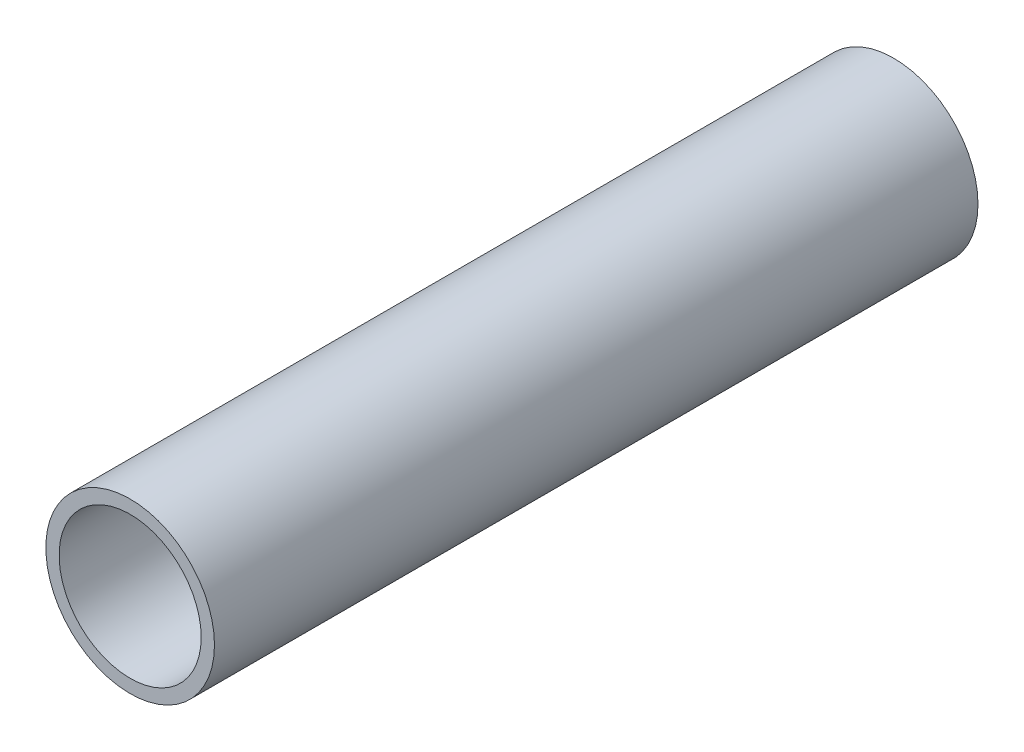
ISO-10303-21;
HEADER;
FILE_DESCRIPTION(('STEP AP214'),'2;1');
FILE_NAME('part.step','',(''),(''),'','','');
FILE_SCHEMA(('AUTOMOTIVE_DESIGN { 1 0 10303 214 1 1 1 1 }'));
ENDSEC;
DATA;
#1=APPLICATION_CONTEXT('core data for automotive mechanical design processes');
#2=APPLICATION_PROTOCOL_DEFINITION('international standard','automotive_design',2000,#1);
#3=PRODUCT_CONTEXT('',#1,'mechanical');
#4=PRODUCT('Part','Part','',(#3));
#5=PRODUCT_RELATED_PRODUCT_CATEGORY('part','',(#4));
#6=PRODUCT_DEFINITION_FORMATION('','',#4);
#7=PRODUCT_DEFINITION_CONTEXT('part definition',#1,'design');
#8=PRODUCT_DEFINITION('design','',#6,#7);
#9=PRODUCT_DEFINITION_SHAPE('','',#8);
#10=(LENGTH_UNIT() NAMED_UNIT(*) SI_UNIT(.MILLI.,.METRE.));
#11=(NAMED_UNIT(*) PLANE_ANGLE_UNIT() SI_UNIT($,.RADIAN.));
#12=(NAMED_UNIT(*) SI_UNIT($,.STERADIAN.) SOLID_ANGLE_UNIT());
#13=UNCERTAINTY_MEASURE_WITH_UNIT(LENGTH_MEASURE(1.E-05),#10,'distance_accuracy_value','');
#14=(GEOMETRIC_REPRESENTATION_CONTEXT(3) GLOBAL_UNCERTAINTY_ASSIGNED_CONTEXT((#13)) GLOBAL_UNIT_ASSIGNED_CONTEXT((#10,
#11,#12)) REPRESENTATION_CONTEXT('',''));
#15=CARTESIAN_POINT('',(0.,0.,0.));
#16=DIRECTION('',(0.,0.,1.));
#17=DIRECTION('',(1.,0.,0.));
#18=AXIS2_PLACEMENT_3D('',#15,#16,#17);
#19=CARTESIAN_POINT('',(0.,0.,115.));
#20=DIRECTION('',(0.,0.,1.));
#21=DIRECTION('',(1.,0.,0.));
#22=AXIS2_PLACEMENT_3D('',#19,#20,#21);
#23=PLANE('',#22);
#24=CARTESIAN_POINT('',(0.,0.,115.));
#25=DIRECTION('',(0.,0.,1.));
#26=DIRECTION('',(1.,0.,0.));
#27=AXIS2_PLACEMENT_3D('',#24,#25,#26);
#28=CIRCLE('',#27,12.7);
#29=CARTESIAN_POINT('',(12.7,0.,115.));
#30=VERTEX_POINT('',#29);
#31=EDGE_CURVE('E10',#30,#30,#28,.T.);
#32=ORIENTED_EDGE('',*,*,#31,.T.);
#33=EDGE_LOOP('',(#32));
#34=FACE_BOUND('',#33,.T.);
#35=CARTESIAN_POINT('',(0.,0.,115.));
#36=DIRECTION('',(0.,0.,1.));
#37=DIRECTION('',(1.,0.,0.));
#38=AXIS2_PLACEMENT_3D('',#35,#36,#37);
#39=CIRCLE('',#38,10.7);
#40=CARTESIAN_POINT('',(10.7,0.,115.));
#41=VERTEX_POINT('',#40);
#42=EDGE_CURVE('E43',#41,#41,#39,.T.);
#43=ORIENTED_EDGE('',*,*,#42,.F.);
#44=EDGE_LOOP('',(#43));
#45=FACE_BOUND('',#44,.T.);
#46=ADVANCED_FACE('F32',(#34,#45),#23,.T.);
#47=CARTESIAN_POINT('',(0.,0.,0.));
#48=DIRECTION('',(0.,0.,1.));
#49=DIRECTION('',(1.,0.,0.));
#50=AXIS2_PLACEMENT_3D('',#47,#48,#49);
#51=PLANE('',#50);
#52=CARTESIAN_POINT('',(0.,0.,0.));
#53=DIRECTION('',(0.,0.,1.));
#54=DIRECTION('',(1.,0.,0.));
#55=AXIS2_PLACEMENT_3D('',#52,#53,#54);
#56=CIRCLE('',#55,12.7);
#57=CARTESIAN_POINT('',(12.7,0.,0.));
#58=VERTEX_POINT('',#57);
#59=EDGE_CURVE('E36',#58,#58,#56,.T.);
#60=ORIENTED_EDGE('',*,*,#59,.F.);
#61=EDGE_LOOP('',(#60));
#62=FACE_BOUND('',#61,.T.);
#63=CARTESIAN_POINT('',(0.,0.,0.));
#64=DIRECTION('',(0.,0.,1.));
#65=DIRECTION('',(1.,0.,0.));
#66=AXIS2_PLACEMENT_3D('',#63,#64,#65);
#67=CIRCLE('',#66,10.7);
#68=CARTESIAN_POINT('',(10.7,0.,0.));
#69=VERTEX_POINT('',#68);
#70=EDGE_CURVE('E45',#69,#69,#67,.T.);
#71=ORIENTED_EDGE('',*,*,#70,.T.);
#72=EDGE_LOOP('',(#71));
#73=FACE_BOUND('',#72,.T.);
#74=ADVANCED_FACE('F55',(#62,#73),#51,.F.);
#75=CARTESIAN_POINT('',(0.,0.,115.));
#76=DIRECTION('',(0.,0.,-1.));
#77=DIRECTION('',(-1.,0.,0.));
#78=AXIS2_PLACEMENT_3D('',#75,#76,#77);
#79=CYLINDRICAL_SURFACE('',#78,12.7);
#80=ORIENTED_EDGE('',*,*,#31,.F.);
#81=EDGE_LOOP('',(#80));
#82=FACE_BOUND('',#81,.T.);
#83=ORIENTED_EDGE('',*,*,#59,.T.);
#84=EDGE_LOOP('',(#83));
#85=FACE_BOUND('',#84,.T.);
#86=ADVANCED_FACE('F34',(#82,#85),#79,.T.);
#87=CARTESIAN_POINT('',(0.,0.,115.));
#88=DIRECTION('',(0.,0.,-1.));
#89=DIRECTION('',(-1.,0.,0.));
#90=AXIS2_PLACEMENT_3D('',#87,#88,#89);
#91=CYLINDRICAL_SURFACE('',#90,10.7);
#92=ORIENTED_EDGE('',*,*,#42,.T.);
#93=EDGE_LOOP('',(#92));
#94=FACE_BOUND('',#93,.T.);
#95=ORIENTED_EDGE('',*,*,#70,.F.);
#96=EDGE_LOOP('',(#95));
#97=FACE_BOUND('',#96,.T.);
#98=ADVANCED_FACE('F51',(#94,#97),#91,.F.);
#99=CLOSED_SHELL('',(#46,#74,#86,#98));
#100=MANIFOLD_SOLID_BREP('B2',#99);
#101=ADVANCED_BREP_SHAPE_REPRESENTATION('',(#18,#100),#14);
#102=SHAPE_DEFINITION_REPRESENTATION(#9,#101);
ENDSEC;
END-ISO-10303-21;
